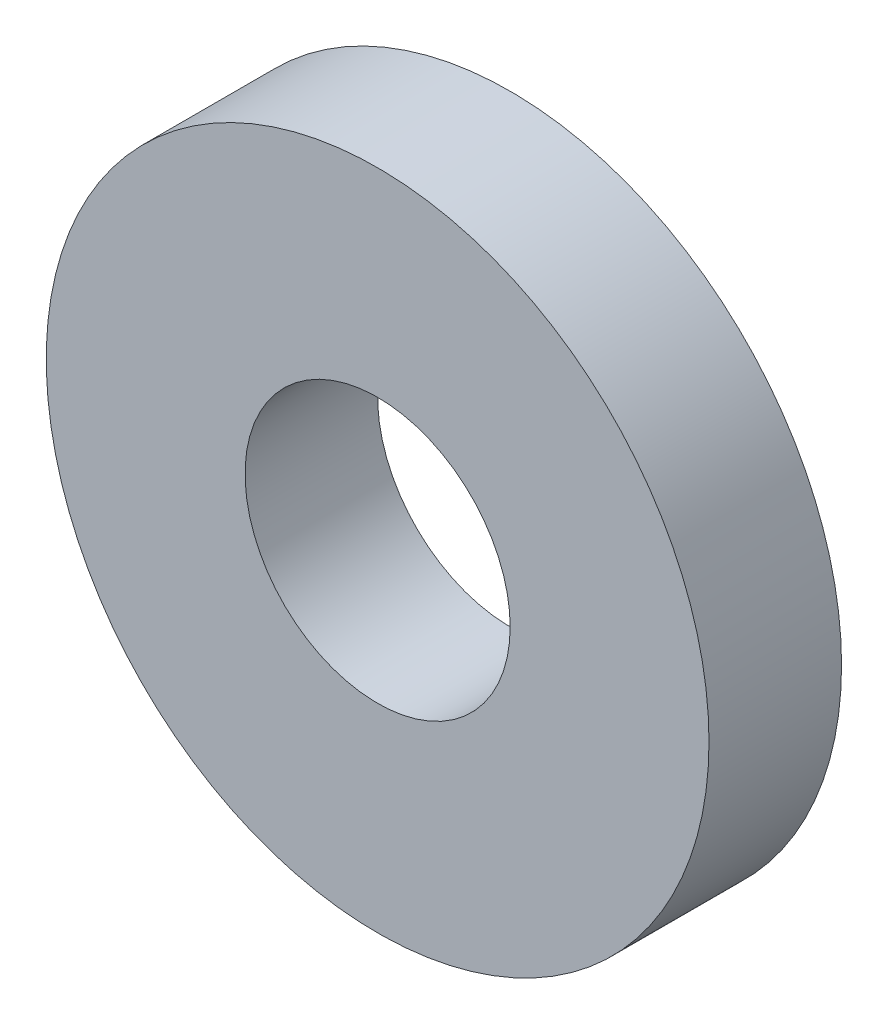
ISO-10303-21;
HEADER;
FILE_DESCRIPTION(('STEP AP214'),'2;1');
FILE_NAME('part.step','',(''),(''),'','','');
FILE_SCHEMA(('AUTOMOTIVE_DESIGN { 1 0 10303 214 1 1 1 1 }'));
ENDSEC;
DATA;
#1=APPLICATION_CONTEXT('core data for automotive mechanical design processes');
#2=APPLICATION_PROTOCOL_DEFINITION('international standard','automotive_design',2000,#1);
#3=PRODUCT_CONTEXT('',#1,'mechanical');
#4=PRODUCT('Part','Part','',(#3));
#5=PRODUCT_RELATED_PRODUCT_CATEGORY('part','',(#4));
#6=PRODUCT_DEFINITION_FORMATION('','',#4);
#7=PRODUCT_DEFINITION_CONTEXT('part definition',#1,'design');
#8=PRODUCT_DEFINITION('design','',#6,#7);
#9=PRODUCT_DEFINITION_SHAPE('','',#8);
#10=(LENGTH_UNIT() NAMED_UNIT(*) SI_UNIT(.MILLI.,.METRE.));
#11=(NAMED_UNIT(*) PLANE_ANGLE_UNIT() SI_UNIT($,.RADIAN.));
#12=(NAMED_UNIT(*) SI_UNIT($,.STERADIAN.) SOLID_ANGLE_UNIT());
#13=UNCERTAINTY_MEASURE_WITH_UNIT(LENGTH_MEASURE(1.E-05),#10,'distance_accuracy_value','');
#14=(GEOMETRIC_REPRESENTATION_CONTEXT(3) GLOBAL_UNCERTAINTY_ASSIGNED_CONTEXT((#13)) GLOBAL_UNIT_ASSIGNED_CONTEXT((#10,
#11,#12)) REPRESENTATION_CONTEXT('',''));
#15=CARTESIAN_POINT('',(0.,0.,0.));
#16=DIRECTION('',(0.,0.,1.));
#17=DIRECTION('',(1.,0.,0.));
#18=AXIS2_PLACEMENT_3D('',#15,#16,#17);
#19=CARTESIAN_POINT('',(0.,92.5,5.));
#20=DIRECTION('',(0.,0.,1.));
#21=DIRECTION('',(1.,0.,0.));
#22=AXIS2_PLACEMENT_3D('',#19,#20,#21);
#23=PLANE('',#22);
#24=CARTESIAN_POINT('',(0.,92.5,5.));
#25=DIRECTION('',(0.,0.,1.));
#26=DIRECTION('',(1.,0.,0.));
#27=AXIS2_PLACEMENT_3D('',#24,#25,#26);
#28=CIRCLE('',#27,12.5);
#29=CARTESIAN_POINT('',(12.5,92.5,5.));
#30=VERTEX_POINT('',#29);
#31=EDGE_CURVE('E10',#30,#30,#28,.T.);
#32=ORIENTED_EDGE('',*,*,#31,.T.);
#33=EDGE_LOOP('',(#32));
#34=FACE_BOUND('',#33,.T.);
#35=CARTESIAN_POINT('',(0.,92.5,5.));
#36=DIRECTION('',(0.,0.,1.));
#37=DIRECTION('',(1.,0.,0.));
#38=AXIS2_PLACEMENT_3D('',#35,#36,#37);
#39=CIRCLE('',#38,5.);
#40=CARTESIAN_POINT('',(5.,92.5,5.));
#41=VERTEX_POINT('',#40);
#42=EDGE_CURVE('E43',#41,#41,#39,.T.);
#43=ORIENTED_EDGE('',*,*,#42,.F.);
#44=EDGE_LOOP('',(#43));
#45=FACE_BOUND('',#44,.T.);
#46=ADVANCED_FACE('F32',(#34,#45),#23,.T.);
#47=CARTESIAN_POINT('',(0.,92.5,0.));
#48=DIRECTION('',(0.,0.,1.));
#49=DIRECTION('',(1.,0.,0.));
#50=AXIS2_PLACEMENT_3D('',#47,#48,#49);
#51=PLANE('',#50);
#52=CARTESIAN_POINT('',(0.,92.5,0.));
#53=DIRECTION('',(0.,0.,1.));
#54=DIRECTION('',(1.,0.,0.));
#55=AXIS2_PLACEMENT_3D('',#52,#53,#54);
#56=CIRCLE('',#55,12.5);
#57=CARTESIAN_POINT('',(12.5,92.5,0.));
#58=VERTEX_POINT('',#57);
#59=EDGE_CURVE('E36',#58,#58,#56,.T.);
#60=ORIENTED_EDGE('',*,*,#59,.F.);
#61=EDGE_LOOP('',(#60));
#62=FACE_BOUND('',#61,.T.);
#63=CARTESIAN_POINT('',(0.,92.5,0.));
#64=DIRECTION('',(0.,0.,1.));
#65=DIRECTION('',(1.,0.,0.));
#66=AXIS2_PLACEMENT_3D('',#63,#64,#65);
#67=CIRCLE('',#66,5.);
#68=CARTESIAN_POINT('',(5.,92.5,0.));
#69=VERTEX_POINT('',#68);
#70=EDGE_CURVE('E45',#69,#69,#67,.T.);
#71=ORIENTED_EDGE('',*,*,#70,.T.);
#72=EDGE_LOOP('',(#71));
#73=FACE_BOUND('',#72,.T.);
#74=ADVANCED_FACE('F55',(#62,#73),#51,.F.);
#75=CARTESIAN_POINT('',(0.,92.5,5.));
#76=DIRECTION('',(0.,0.,-1.));
#77=DIRECTION('',(-1.,0.,0.));
#78=AXIS2_PLACEMENT_3D('',#75,#76,#77);
#79=CYLINDRICAL_SURFACE('',#78,12.5);
#80=ORIENTED_EDGE('',*,*,#31,.F.);
#81=EDGE_LOOP('',(#80));
#82=FACE_BOUND('',#81,.T.);
#83=ORIENTED_EDGE('',*,*,#59,.T.);
#84=EDGE_LOOP('',(#83));
#85=FACE_BOUND('',#84,.T.);
#86=ADVANCED_FACE('F34',(#82,#85),#79,.T.);
#87=CARTESIAN_POINT('',(0.,92.5,5.));
#88=DIRECTION('',(0.,0.,-1.));
#89=DIRECTION('',(-1.,0.,0.));
#90=AXIS2_PLACEMENT_3D('',#87,#88,#89);
#91=CYLINDRICAL_SURFACE('',#90,5.);
#92=ORIENTED_EDGE('',*,*,#42,.T.);
#93=EDGE_LOOP('',(#92));
#94=FACE_BOUND('',#93,.T.);
#95=ORIENTED_EDGE('',*,*,#70,.F.);
#96=EDGE_LOOP('',(#95));
#97=FACE_BOUND('',#96,.T.);
#98=ADVANCED_FACE('F51',(#94,#97),#91,.F.);
#99=CLOSED_SHELL('',(#46,#74,#86,#98));
#100=MANIFOLD_SOLID_BREP('B2',#99);
#101=ADVANCED_BREP_SHAPE_REPRESENTATION('',(#18,#100),#14);
#102=SHAPE_DEFINITION_REPRESENTATION(#9,#101);
ENDSEC;
END-ISO-10303-21;
